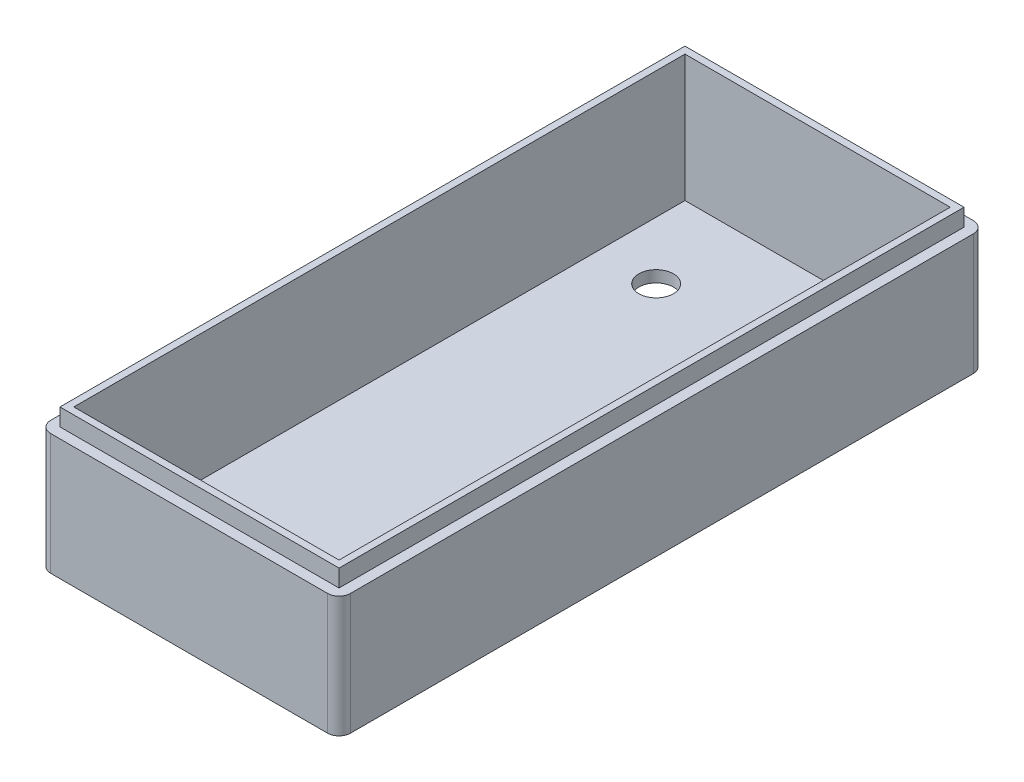
ISO-10303-21;
HEADER;
FILE_DESCRIPTION(('STEP AP214'),'2;1');
FILE_NAME('part.step','',(''),(''),'','','');
FILE_SCHEMA(('AUTOMOTIVE_DESIGN { 1 0 10303 214 1 1 1 1 }'));
ENDSEC;
DATA;
#1=APPLICATION_CONTEXT('core data for automotive mechanical design processes');
#2=APPLICATION_PROTOCOL_DEFINITION('international standard','automotive_design',2000,#1);
#3=PRODUCT_CONTEXT('',#1,'mechanical');
#4=PRODUCT('Part','Part','',(#3));
#5=PRODUCT_RELATED_PRODUCT_CATEGORY('part','',(#4));
#6=PRODUCT_DEFINITION_FORMATION('','',#4);
#7=PRODUCT_DEFINITION_CONTEXT('part definition',#1,'design');
#8=PRODUCT_DEFINITION('design','',#6,#7);
#9=PRODUCT_DEFINITION_SHAPE('','',#8);
#10=(LENGTH_UNIT() NAMED_UNIT(*) SI_UNIT(.MILLI.,.METRE.));
#11=(NAMED_UNIT(*) PLANE_ANGLE_UNIT() SI_UNIT($,.RADIAN.));
#12=(NAMED_UNIT(*) SI_UNIT($,.STERADIAN.) SOLID_ANGLE_UNIT());
#13=UNCERTAINTY_MEASURE_WITH_UNIT(LENGTH_MEASURE(1.E-05),#10,'distance_accuracy_value','');
#14=(GEOMETRIC_REPRESENTATION_CONTEXT(3) GLOBAL_UNCERTAINTY_ASSIGNED_CONTEXT((#13)) GLOBAL_UNIT_ASSIGNED_CONTEXT((#10,
#11,#12)) REPRESENTATION_CONTEXT('',''));
#15=CARTESIAN_POINT('',(0.,0.,0.));
#16=DIRECTION('',(0.,0.,1.));
#17=DIRECTION('',(1.,0.,0.));
#18=AXIS2_PLACEMENT_3D('',#15,#16,#17);
#19=CARTESIAN_POINT('',(0.,2.,0.));
#20=DIRECTION('',(0.,1.,0.));
#21=DIRECTION('',(0.,0.,1.));
#22=AXIS2_PLACEMENT_3D('',#19,#20,#21);
#23=PLANE('',#22);
#24=CARTESIAN_POINT('',(-65.0225872689938,2.,39.9199178644764));
#25=DIRECTION('',(0.,1.,0.));
#26=DIRECTION('',(0.,0.,1.));
#27=AXIS2_PLACEMENT_3D('',#24,#25,#26);
#28=CIRCLE('',#27,6.);
#29=CARTESIAN_POINT('',(-65.0225872689938,2.,45.9199178644764));
#30=VERTEX_POINT('',#29);
#31=EDGE_CURVE('E375',#30,#30,#28,.T.);
#32=ORIENTED_EDGE('',*,*,#31,.F.);
#33=EDGE_LOOP('',(#32));
#34=FACE_BOUND('',#33,.T.);
#35=CARTESIAN_POINT('',(-65.0225872689938,2.,-36.0800821355236));
#36=DIRECTION('',(0.,1.,0.));
#37=DIRECTION('',(0.,0.,1.));
#38=AXIS2_PLACEMENT_3D('',#35,#36,#37);
#39=CIRCLE('',#38,3.00000000000001);
#40=CARTESIAN_POINT('',(-65.0225872689938,2.,-33.0800821355236));
#41=VERTEX_POINT('',#40);
#42=EDGE_CURVE('E275',#41,#41,#39,.T.);
#43=ORIENTED_EDGE('',*,*,#42,.F.);
#44=EDGE_LOOP('',(#43));
#45=FACE_BOUND('',#44,.T.);
#46=DIRECTION('',(0.,0.,-1.));
#47=VECTOR('',#46,1.);
#48=CARTESIAN_POINT('',(-29.0225872689938,2.,-51.0800821355236));
#49=LINE('',#48,#47);
#50=CARTESIAN_POINT('',(-29.0225872689938,2.,54.9199178644764));
#51=VERTEX_POINT('',#50);
#52=CARTESIAN_POINT('',(-29.0225872689938,2.,-51.0800821355236));
#53=VERTEX_POINT('',#52);
#54=EDGE_CURVE('E335',#51,#53,#49,.T.);
#55=ORIENTED_EDGE('',*,*,#54,.T.);
#56=DIRECTION('',(-1.,0.,0.));
#57=VECTOR('',#56,1.);
#58=CARTESIAN_POINT('',(-75.0225872689938,2.,-51.0800821355236));
#59=LINE('',#58,#57);
#60=CARTESIAN_POINT('',(-75.0225872689938,2.,-51.0800821355236));
#61=VERTEX_POINT('',#60);
#62=EDGE_CURVE('E327',#53,#61,#59,.T.);
#63=ORIENTED_EDGE('',*,*,#62,.T.);
#64=DIRECTION('',(0.,0.,1.));
#65=VECTOR('',#64,1.);
#66=CARTESIAN_POINT('',(-75.0225872689938,2.,-51.0800821355236));
#67=LINE('',#66,#65);
#68=CARTESIAN_POINT('',(-75.0225872689938,2.,54.9199178644764));
#69=VERTEX_POINT('',#68);
#70=EDGE_CURVE('E330',#61,#69,#67,.T.);
#71=ORIENTED_EDGE('',*,*,#70,.T.);
#72=DIRECTION('',(1.,0.,0.));
#73=VECTOR('',#72,1.);
#74=CARTESIAN_POINT('',(-75.0225872689938,2.,54.9199178644764));
#75=LINE('',#74,#73);
#76=EDGE_CURVE('E332',#69,#51,#75,.T.);
#77=ORIENTED_EDGE('',*,*,#76,.T.);
#78=EDGE_LOOP('',(#55,#63,#71,#77));
#79=FACE_BOUND('',#78,.T.);
#80=ADVANCED_FACE('F131',(#34,#45,#79),#23,.T.);
#81=CARTESIAN_POINT('',(-76.0225872689938,0.,55.9199178644764));
#82=DIRECTION('',(0.,1.,0.));
#83=DIRECTION('',(0.,0.,1.));
#84=AXIS2_PLACEMENT_3D('',#81,#82,#83);
#85=CYLINDRICAL_SURFACE('',#84,2.);
#86=DIRECTION('',(0.,1.,0.));
#87=VECTOR('',#86,1.);
#88=CARTESIAN_POINT('',(-76.0225872689938,0.,57.9199178644764));
#89=LINE('',#88,#87);
#90=CARTESIAN_POINT('',(-76.0225872689938,21.,57.9199178644764));
#91=VERTEX_POINT('',#90);
#92=CARTESIAN_POINT('',(-76.0225872689938,0.,57.9199178644764));
#93=VERTEX_POINT('',#92);
#94=EDGE_CURVE('E370',#91,#93,#89,.F.);
#95=ORIENTED_EDGE('',*,*,#94,.F.);
#96=CARTESIAN_POINT('',(-76.0225872689938,21.,55.9199178644764));
#97=DIRECTION('',(0.,1.,0.));
#98=DIRECTION('',(0.,0.,1.));
#99=AXIS2_PLACEMENT_3D('',#96,#97,#98);
#100=CIRCLE('',#99,2.);
#101=CARTESIAN_POINT('',(-78.0225872689938,21.,55.9199178644764));
#102=VERTEX_POINT('',#101);
#103=EDGE_CURVE('E301',#91,#102,#100,.F.);
#104=ORIENTED_EDGE('',*,*,#103,.T.);
#105=DIRECTION('',(0.,1.,0.));
#106=VECTOR('',#105,1.);
#107=CARTESIAN_POINT('',(-78.0225872689938,0.,55.9199178644764));
#108=LINE('',#107,#106);
#109=CARTESIAN_POINT('',(-78.0225872689938,0.,55.9199178644764));
#110=VERTEX_POINT('',#109);
#111=EDGE_CURVE('E352',#110,#102,#108,.T.);
#112=ORIENTED_EDGE('',*,*,#111,.F.);
#113=CARTESIAN_POINT('',(-76.0225872689938,0.,55.9199178644764));
#114=DIRECTION('',(0.,1.,0.));
#115=DIRECTION('',(0.,0.,1.));
#116=AXIS2_PLACEMENT_3D('',#113,#114,#115);
#117=CIRCLE('',#116,2.);
#118=EDGE_CURVE('E357',#93,#110,#117,.F.);
#119=ORIENTED_EDGE('',*,*,#118,.F.);
#120=EDGE_LOOP('',(#95,#104,#112,#119));
#121=FACE_BOUND('',#120,.T.);
#122=ADVANCED_FACE('F133',(#121),#85,.T.);
#123=CARTESIAN_POINT('',(-28.0225872689938,0.,-52.0800821355236));
#124=DIRECTION('',(0.,1.,0.));
#125=DIRECTION('',(0.,0.,1.));
#126=AXIS2_PLACEMENT_3D('',#123,#124,#125);
#127=CYLINDRICAL_SURFACE('',#126,2.);
#128=DIRECTION('',(0.,1.,0.));
#129=VECTOR('',#128,1.);
#130=CARTESIAN_POINT('',(-28.0225872689938,0.,-54.0800821355236));
#131=LINE('',#130,#129);
#132=CARTESIAN_POINT('',(-28.0225872689938,21.,-54.0800821355236));
#133=VERTEX_POINT('',#132);
#134=CARTESIAN_POINT('',(-28.0225872689938,0.,-54.0800821355236));
#135=VERTEX_POINT('',#134);
#136=EDGE_CURVE('E347',#133,#135,#131,.F.);
#137=ORIENTED_EDGE('',*,*,#136,.F.);
#138=CARTESIAN_POINT('',(-28.0225872689938,21.,-52.0800821355236));
#139=DIRECTION('',(0.,1.,0.));
#140=DIRECTION('',(0.,0.,1.));
#141=AXIS2_PLACEMENT_3D('',#138,#139,#140);
#142=CIRCLE('',#141,2.);
#143=CARTESIAN_POINT('',(-26.0225872689938,21.,-52.0800821355236));
#144=VERTEX_POINT('',#143);
#145=EDGE_CURVE('E289',#133,#144,#142,.F.);
#146=ORIENTED_EDGE('',*,*,#145,.T.);
#147=DIRECTION('',(0.,1.,0.));
#148=VECTOR('',#147,1.);
#149=CARTESIAN_POINT('',(-26.0225872689938,0.,-52.0800821355236));
#150=LINE('',#149,#148);
#151=CARTESIAN_POINT('',(-26.0225872689938,0.,-52.0800821355236));
#152=VERTEX_POINT('',#151);
#153=EDGE_CURVE('E367',#152,#144,#150,.T.);
#154=ORIENTED_EDGE('',*,*,#153,.F.);
#155=CARTESIAN_POINT('',(-28.0225872689938,0.,-52.0800821355236));
#156=DIRECTION('',(0.,1.,0.));
#157=DIRECTION('',(0.,0.,1.));
#158=AXIS2_PLACEMENT_3D('',#155,#156,#157);
#159=CIRCLE('',#158,2.);
#160=EDGE_CURVE('E361',#135,#152,#159,.F.);
#161=ORIENTED_EDGE('',*,*,#160,.F.);
#162=EDGE_LOOP('',(#137,#146,#154,#161));
#163=FACE_BOUND('',#162,.T.);
#164=ADVANCED_FACE('F467',(#163),#127,.T.);
#165=CARTESIAN_POINT('',(-76.0225872689938,0.,-52.0800821355236));
#166=DIRECTION('',(0.,1.,0.));
#167=DIRECTION('',(0.,0.,1.));
#168=AXIS2_PLACEMENT_3D('',#165,#166,#167);
#169=CYLINDRICAL_SURFACE('',#168,2.);
#170=DIRECTION('',(0.,1.,0.));
#171=VECTOR('',#170,1.);
#172=CARTESIAN_POINT('',(-78.0225872689938,0.,-52.0800821355236));
#173=LINE('',#172,#171);
#174=CARTESIAN_POINT('',(-78.0225872689938,21.,-52.0800821355236));
#175=VERTEX_POINT('',#174);
#176=CARTESIAN_POINT('',(-78.0225872689938,0.,-52.0800821355236));
#177=VERTEX_POINT('',#176);
#178=EDGE_CURVE('E355',#175,#177,#173,.F.);
#179=ORIENTED_EDGE('',*,*,#178,.F.);
#180=CARTESIAN_POINT('',(-76.0225872689938,21.,-52.0800821355236));
#181=DIRECTION('',(0.,1.,0.));
#182=DIRECTION('',(0.,0.,1.));
#183=AXIS2_PLACEMENT_3D('',#180,#181,#182);
#184=CIRCLE('',#183,2.);
#185=CARTESIAN_POINT('',(-76.0225872689938,21.,-54.0800821355236));
#186=VERTEX_POINT('',#185);
#187=EDGE_CURVE('E298',#175,#186,#184,.F.);
#188=ORIENTED_EDGE('',*,*,#187,.T.);
#189=DIRECTION('',(0.,1.,0.));
#190=VECTOR('',#189,1.);
#191=CARTESIAN_POINT('',(-76.0225872689938,0.,-54.0800821355236));
#192=LINE('',#191,#190);
#193=CARTESIAN_POINT('',(-76.0225872689938,0.,-54.0800821355236));
#194=VERTEX_POINT('',#193);
#195=EDGE_CURVE('E349',#194,#186,#192,.T.);
#196=ORIENTED_EDGE('',*,*,#195,.F.);
#197=CARTESIAN_POINT('',(-76.0225872689938,0.,-52.0800821355236));
#198=DIRECTION('',(0.,1.,0.));
#199=DIRECTION('',(0.,0.,1.));
#200=AXIS2_PLACEMENT_3D('',#197,#198,#199);
#201=CIRCLE('',#200,2.);
#202=EDGE_CURVE('E363',#177,#194,#201,.F.);
#203=ORIENTED_EDGE('',*,*,#202,.F.);
#204=EDGE_LOOP('',(#179,#188,#196,#203));
#205=FACE_BOUND('',#204,.T.);
#206=ADVANCED_FACE('F449',(#205),#169,.T.);
#207=CARTESIAN_POINT('',(-26.0225872689938,0.,-54.0800821355236));
#208=DIRECTION('',(0.,0.,-1.));
#209=DIRECTION('',(-1.,0.,0.));
#210=AXIS2_PLACEMENT_3D('',#207,#208,#209);
#211=PLANE('',#210);
#212=ORIENTED_EDGE('',*,*,#195,.T.);
#213=DIRECTION('',(1.,0.,0.));
#214=VECTOR('',#213,1.);
#215=CARTESIAN_POINT('',(-26.0225872689938,21.,-54.0800821355236));
#216=LINE('',#215,#214);
#217=EDGE_CURVE('E295',#186,#133,#216,.T.);
#218=ORIENTED_EDGE('',*,*,#217,.T.);
#219=ORIENTED_EDGE('',*,*,#136,.T.);
#220=DIRECTION('',(-1.,0.,0.));
#221=VECTOR('',#220,1.);
#222=CARTESIAN_POINT('',(-26.0225872689938,0.,-54.0800821355236));
#223=LINE('',#222,#221);
#224=EDGE_CURVE('E318',#135,#194,#223,.T.);
#225=ORIENTED_EDGE('',*,*,#224,.T.);
#226=EDGE_LOOP('',(#212,#218,#219,#225));
#227=FACE_BOUND('',#226,.T.);
#228=ADVANCED_FACE('F445',(#227),#211,.T.);
#229=CARTESIAN_POINT('',(-78.0225872689938,0.,-54.0800821355236));
#230=DIRECTION('',(-1.,0.,0.));
#231=DIRECTION('',(0.,0.,1.));
#232=AXIS2_PLACEMENT_3D('',#229,#230,#231);
#233=PLANE('',#232);
#234=ORIENTED_EDGE('',*,*,#111,.T.);
#235=DIRECTION('',(0.,0.,-1.));
#236=VECTOR('',#235,1.);
#237=CARTESIAN_POINT('',(-78.0225872689938,21.,-54.0800821355236));
#238=LINE('',#237,#236);
#239=EDGE_CURVE('E304',#102,#175,#238,.T.);
#240=ORIENTED_EDGE('',*,*,#239,.T.);
#241=ORIENTED_EDGE('',*,*,#178,.T.);
#242=DIRECTION('',(0.,0.,1.));
#243=VECTOR('',#242,1.);
#244=CARTESIAN_POINT('',(-78.0225872689938,0.,-54.0800821355236));
#245=LINE('',#244,#243);
#246=EDGE_CURVE('E321',#177,#110,#245,.T.);
#247=ORIENTED_EDGE('',*,*,#246,.T.);
#248=EDGE_LOOP('',(#234,#240,#241,#247));
#249=FACE_BOUND('',#248,.T.);
#250=ADVANCED_FACE('F442',(#249),#233,.T.);
#251=CARTESIAN_POINT('',(-28.0225872689938,0.,55.9199178644764));
#252=DIRECTION('',(0.,1.,0.));
#253=DIRECTION('',(0.,0.,1.));
#254=AXIS2_PLACEMENT_3D('',#251,#252,#253);
#255=CYLINDRICAL_SURFACE('',#254,2.);
#256=DIRECTION('',(0.,1.,0.));
#257=VECTOR('',#256,1.);
#258=CARTESIAN_POINT('',(-26.0225872689938,0.,55.9199178644764));
#259=LINE('',#258,#257);
#260=CARTESIAN_POINT('',(-26.0225872689938,21.,55.9199178644764));
#261=VERTEX_POINT('',#260);
#262=CARTESIAN_POINT('',(-26.0225872689938,0.,55.9199178644764));
#263=VERTEX_POINT('',#262);
#264=EDGE_CURVE('E365',#261,#263,#259,.F.);
#265=ORIENTED_EDGE('',*,*,#264,.F.);
#266=CARTESIAN_POINT('',(-28.0225872689938,21.,55.9199178644764));
#267=DIRECTION('',(0.,1.,0.));
#268=DIRECTION('',(0.,0.,1.));
#269=AXIS2_PLACEMENT_3D('',#266,#267,#268);
#270=CIRCLE('',#269,2.);
#271=CARTESIAN_POINT('',(-28.0225872689938,21.,57.9199178644764));
#272=VERTEX_POINT('',#271);
#273=EDGE_CURVE('E148',#261,#272,#270,.F.);
#274=ORIENTED_EDGE('',*,*,#273,.T.);
#275=DIRECTION('',(0.,1.,0.));
#276=VECTOR('',#275,1.);
#277=CARTESIAN_POINT('',(-28.0225872689938,0.,57.9199178644764));
#278=LINE('',#277,#276);
#279=CARTESIAN_POINT('',(-28.0225872689938,0.,57.9199178644764));
#280=VERTEX_POINT('',#279);
#281=EDGE_CURVE('E140',#280,#272,#278,.T.);
#282=ORIENTED_EDGE('',*,*,#281,.F.);
#283=CARTESIAN_POINT('',(-28.0225872689938,0.,55.9199178644764));
#284=DIRECTION('',(0.,1.,0.));
#285=DIRECTION('',(0.,0.,1.));
#286=AXIS2_PLACEMENT_3D('',#283,#284,#285);
#287=CIRCLE('',#286,2.);
#288=EDGE_CURVE('E359',#263,#280,#287,.F.);
#289=ORIENTED_EDGE('',*,*,#288,.F.);
#290=EDGE_LOOP('',(#265,#274,#282,#289));
#291=FACE_BOUND('',#290,.T.);
#292=ADVANCED_FACE('F440',(#291),#255,.T.);
#293=CARTESIAN_POINT('',(-78.0225872689938,0.,57.9199178644764));
#294=DIRECTION('',(0.,0.,1.));
#295=DIRECTION('',(1.,0.,0.));
#296=AXIS2_PLACEMENT_3D('',#293,#294,#295);
#297=PLANE('',#296);
#298=ORIENTED_EDGE('',*,*,#281,.T.);
#299=DIRECTION('',(-1.,0.,0.));
#300=VECTOR('',#299,1.);
#301=CARTESIAN_POINT('',(-78.0225872689938,21.,57.9199178644764));
#302=LINE('',#301,#300);
#303=EDGE_CURVE('E292',#272,#91,#302,.T.);
#304=ORIENTED_EDGE('',*,*,#303,.T.);
#305=ORIENTED_EDGE('',*,*,#94,.T.);
#306=DIRECTION('',(1.,0.,0.));
#307=VECTOR('',#306,1.);
#308=CARTESIAN_POINT('',(-78.0225872689938,0.,57.9199178644764));
#309=LINE('',#308,#307);
#310=EDGE_CURVE('E324',#93,#280,#309,.T.);
#311=ORIENTED_EDGE('',*,*,#310,.T.);
#312=EDGE_LOOP('',(#298,#304,#305,#311));
#313=FACE_BOUND('',#312,.T.);
#314=ADVANCED_FACE('F437',(#313),#297,.T.);
#315=CARTESIAN_POINT('',(-26.0225872689938,0.,57.9199178644764));
#316=DIRECTION('',(1.,0.,0.));
#317=DIRECTION('',(0.,0.,-1.));
#318=AXIS2_PLACEMENT_3D('',#315,#316,#317);
#319=PLANE('',#318);
#320=ORIENTED_EDGE('',*,*,#153,.T.);
#321=DIRECTION('',(0.,0.,1.));
#322=VECTOR('',#321,1.);
#323=CARTESIAN_POINT('',(-26.0225872689938,21.,57.9199178644764));
#324=LINE('',#323,#322);
#325=EDGE_CURVE('E12',#144,#261,#324,.T.);
#326=ORIENTED_EDGE('',*,*,#325,.T.);
#327=ORIENTED_EDGE('',*,*,#264,.T.);
#328=DIRECTION('',(0.,0.,-1.));
#329=VECTOR('',#328,1.);
#330=CARTESIAN_POINT('',(-26.0225872689938,0.,57.9199178644764));
#331=LINE('',#330,#329);
#332=EDGE_CURVE('E315',#263,#152,#331,.T.);
#333=ORIENTED_EDGE('',*,*,#332,.T.);
#334=EDGE_LOOP('',(#320,#326,#327,#333));
#335=FACE_BOUND('',#334,.T.);
#336=ADVANCED_FACE('F416',(#335),#319,.T.);
#337=CARTESIAN_POINT('',(-84.3922729527369,24.,-72.0800821355236));
#338=DIRECTION('',(0.,-1.,0.));
#339=DIRECTION('',(0.,0.,-1.));
#340=AXIS2_PLACEMENT_3D('',#337,#338,#339);
#341=PLANE('',#340);
#342=DIRECTION('',(1.,0.,0.));
#343=VECTOR('',#342,1.);
#344=CARTESIAN_POINT('',(-75.0225872689938,24.,-51.0800821355236));
#345=LINE('',#344,#343);
#346=CARTESIAN_POINT('',(-75.0225872689938,24.,-51.0800821355236));
#347=VERTEX_POINT('',#346);
#348=CARTESIAN_POINT('',(-29.0225872689938,24.,-51.0800821355236));
#349=VERTEX_POINT('',#348);
#350=EDGE_CURVE('E313',#347,#349,#345,.T.);
#351=ORIENTED_EDGE('',*,*,#350,.T.);
#352=DIRECTION('',(0.,0.,1.));
#353=VECTOR('',#352,1.);
#354=CARTESIAN_POINT('',(-29.0225872689938,24.,-51.0800821355236));
#355=LINE('',#354,#353);
#356=CARTESIAN_POINT('',(-29.0225872689938,24.,54.9199178644764));
#357=VERTEX_POINT('',#356);
#358=EDGE_CURVE('E307',#349,#357,#355,.T.);
#359=ORIENTED_EDGE('',*,*,#358,.T.);
#360=DIRECTION('',(-1.,0.,0.));
#361=VECTOR('',#360,1.);
#362=CARTESIAN_POINT('',(-75.0225872689938,24.,54.9199178644764));
#363=LINE('',#362,#361);
#364=CARTESIAN_POINT('',(-75.0225872689938,24.,54.9199178644764));
#365=VERTEX_POINT('',#364);
#366=EDGE_CURVE('E309',#357,#365,#363,.T.);
#367=ORIENTED_EDGE('',*,*,#366,.T.);
#368=DIRECTION('',(0.,0.,-1.));
#369=VECTOR('',#368,1.);
#370=CARTESIAN_POINT('',(-75.0225872689938,24.,-51.0800821355236));
#371=LINE('',#370,#369);
#372=EDGE_CURVE('E311',#365,#347,#371,.T.);
#373=ORIENTED_EDGE('',*,*,#372,.T.);
#374=EDGE_LOOP('',(#351,#359,#367,#373));
#375=FACE_BOUND('',#374,.T.);
#376=DIRECTION('',(0.,0.,1.));
#377=VECTOR('',#376,1.);
#378=CARTESIAN_POINT('',(-76.2225872689938,24.,-52.2800821355236));
#379=LINE('',#378,#377);
#380=CARTESIAN_POINT('',(-76.2225872689938,24.,-52.2800821355236));
#381=VERTEX_POINT('',#380);
#382=CARTESIAN_POINT('',(-76.2225872689938,24.,56.1199178644764));
#383=VERTEX_POINT('',#382);
#384=EDGE_CURVE('E280',#381,#383,#379,.T.);
#385=ORIENTED_EDGE('',*,*,#384,.T.);
#386=DIRECTION('',(1.,0.,0.));
#387=VECTOR('',#386,1.);
#388=CARTESIAN_POINT('',(-76.2225872689938,24.,56.1199178644764));
#389=LINE('',#388,#387);
#390=CARTESIAN_POINT('',(-27.8225872689938,24.,56.1199178644764));
#391=VERTEX_POINT('',#390);
#392=EDGE_CURVE('E251',#383,#391,#389,.T.);
#393=ORIENTED_EDGE('',*,*,#392,.T.);
#394=DIRECTION('',(0.,0.,-1.));
#395=VECTOR('',#394,1.);
#396=CARTESIAN_POINT('',(-27.8225872689938,24.,56.1199178644764));
#397=LINE('',#396,#395);
#398=CARTESIAN_POINT('',(-27.8225872689938,24.,-52.2800821355236));
#399=VERTEX_POINT('',#398);
#400=EDGE_CURVE('E155',#391,#399,#397,.T.);
#401=ORIENTED_EDGE('',*,*,#400,.T.);
#402=DIRECTION('',(-1.,0.,0.));
#403=VECTOR('',#402,1.);
#404=CARTESIAN_POINT('',(-27.8225872689938,24.,-52.2800821355236));
#405=LINE('',#404,#403);
#406=EDGE_CURVE('E270',#399,#381,#405,.T.);
#407=ORIENTED_EDGE('',*,*,#406,.T.);
#408=EDGE_LOOP('',(#385,#393,#401,#407));
#409=FACE_BOUND('',#408,.T.);
#410=ADVANCED_FACE('F413',(#375,#409),#341,.F.);
#411=CARTESIAN_POINT('',(-75.0225872689938,13.,-51.0800821355236));
#412=DIRECTION('',(0.,0.,1.));
#413=DIRECTION('',(1.,0.,0.));
#414=AXIS2_PLACEMENT_3D('',#411,#412,#413);
#415=PLANE('',#414);
#416=ORIENTED_EDGE('',*,*,#350,.F.);
#417=DIRECTION('',(0.,-1.,0.));
#418=VECTOR('',#417,1.);
#419=CARTESIAN_POINT('',(-75.0225872689938,13.,-51.0800821355236));
#420=LINE('',#419,#418);
#421=EDGE_CURVE('E345',#347,#61,#420,.T.);
#422=ORIENTED_EDGE('',*,*,#421,.T.);
#423=ORIENTED_EDGE('',*,*,#62,.F.);
#424=DIRECTION('',(0.,-1.,0.));
#425=VECTOR('',#424,1.);
#426=CARTESIAN_POINT('',(-29.0225872689938,13.,-51.0800821355236));
#427=LINE('',#426,#425);
#428=EDGE_CURVE('E337',#349,#53,#427,.T.);
#429=ORIENTED_EDGE('',*,*,#428,.F.);
#430=EDGE_LOOP('',(#416,#422,#423,#429));
#431=FACE_BOUND('',#430,.T.);
#432=ADVANCED_FACE('F403',(#431),#415,.T.);
#433=CARTESIAN_POINT('',(-75.0225872689938,13.,-51.0800821355236));
#434=DIRECTION('',(1.,0.,0.));
#435=DIRECTION('',(0.,0.,-1.));
#436=AXIS2_PLACEMENT_3D('',#433,#434,#435);
#437=PLANE('',#436);
#438=DIRECTION('',(0.,-1.,0.));
#439=VECTOR('',#438,1.);
#440=CARTESIAN_POINT('',(-75.0225872689938,13.,54.9199178644764));
#441=LINE('',#440,#439);
#442=EDGE_CURVE('E342',#365,#69,#441,.T.);
#443=ORIENTED_EDGE('',*,*,#442,.T.);
#444=ORIENTED_EDGE('',*,*,#70,.F.);
#445=ORIENTED_EDGE('',*,*,#421,.F.);
#446=ORIENTED_EDGE('',*,*,#372,.F.);
#447=EDGE_LOOP('',(#443,#444,#445,#446));
#448=FACE_BOUND('',#447,.T.);
#449=ADVANCED_FACE('F407',(#448),#437,.T.);
#450=CARTESIAN_POINT('',(-75.0225872689938,13.,54.9199178644764));
#451=DIRECTION('',(0.,0.,-1.));
#452=DIRECTION('',(-1.,0.,0.));
#453=AXIS2_PLACEMENT_3D('',#450,#451,#452);
#454=PLANE('',#453);
#455=ORIENTED_EDGE('',*,*,#366,.F.);
#456=DIRECTION('',(0.,-1.,0.));
#457=VECTOR('',#456,1.);
#458=CARTESIAN_POINT('',(-29.0225872689938,13.,54.9199178644764));
#459=LINE('',#458,#457);
#460=EDGE_CURVE('E340',#357,#51,#459,.T.);
#461=ORIENTED_EDGE('',*,*,#460,.T.);
#462=ORIENTED_EDGE('',*,*,#76,.F.);
#463=ORIENTED_EDGE('',*,*,#442,.F.);
#464=EDGE_LOOP('',(#455,#461,#462,#463));
#465=FACE_BOUND('',#464,.T.);
#466=ADVANCED_FACE('F411',(#465),#454,.T.);
#467=CARTESIAN_POINT('',(-29.0225872689938,13.,-51.0800821355236));
#468=DIRECTION('',(-1.,0.,0.));
#469=DIRECTION('',(0.,0.,1.));
#470=AXIS2_PLACEMENT_3D('',#467,#468,#469);
#471=PLANE('',#470);
#472=ORIENTED_EDGE('',*,*,#358,.F.);
#473=ORIENTED_EDGE('',*,*,#428,.T.);
#474=ORIENTED_EDGE('',*,*,#54,.F.);
#475=ORIENTED_EDGE('',*,*,#460,.F.);
#476=EDGE_LOOP('',(#472,#473,#474,#475));
#477=FACE_BOUND('',#476,.T.);
#478=ADVANCED_FACE('F400',(#477),#471,.T.);
#479=CARTESIAN_POINT('',(0.,0.,0.));
#480=DIRECTION('',(0.,1.,0.));
#481=DIRECTION('',(0.,0.,1.));
#482=AXIS2_PLACEMENT_3D('',#479,#480,#481);
#483=PLANE('',#482);
#484=CARTESIAN_POINT('',(-65.0225872689938,0.,39.9199178644764));
#485=DIRECTION('',(0.,1.,0.));
#486=DIRECTION('',(0.,0.,1.));
#487=AXIS2_PLACEMENT_3D('',#484,#485,#486);
#488=CIRCLE('',#487,6.);
#489=CARTESIAN_POINT('',(-65.0225872689938,0.,45.9199178644764));
#490=VERTEX_POINT('',#489);
#491=EDGE_CURVE('E135',#490,#490,#488,.T.);
#492=ORIENTED_EDGE('',*,*,#491,.T.);
#493=EDGE_LOOP('',(#492));
#494=FACE_BOUND('',#493,.T.);
#495=CARTESIAN_POINT('',(-65.0225872689938,0.,-36.0800821355236));
#496=DIRECTION('',(0.,1.,0.));
#497=DIRECTION('',(0.,0.,1.));
#498=AXIS2_PLACEMENT_3D('',#495,#496,#497);
#499=CIRCLE('',#498,3.00000000000001);
#500=CARTESIAN_POINT('',(-65.0225872689938,0.,-33.0800821355236));
#501=VERTEX_POINT('',#500);
#502=EDGE_CURVE('E373',#501,#501,#499,.T.);
#503=ORIENTED_EDGE('',*,*,#502,.T.);
#504=EDGE_LOOP('',(#503));
#505=FACE_BOUND('',#504,.T.);
#506=ORIENTED_EDGE('',*,*,#246,.F.);
#507=ORIENTED_EDGE('',*,*,#202,.T.);
#508=ORIENTED_EDGE('',*,*,#224,.F.);
#509=ORIENTED_EDGE('',*,*,#160,.T.);
#510=ORIENTED_EDGE('',*,*,#332,.F.);
#511=ORIENTED_EDGE('',*,*,#288,.T.);
#512=ORIENTED_EDGE('',*,*,#310,.F.);
#513=ORIENTED_EDGE('',*,*,#118,.T.);
#514=EDGE_LOOP('',(#506,#507,#508,#509,#510,#511,#512,#513));
#515=FACE_BOUND('',#514,.T.);
#516=ADVANCED_FACE('F435',(#494,#505,#515),#483,.F.);
#517=CARTESIAN_POINT('',(0.,21.,0.));
#518=DIRECTION('',(0.,1.,0.));
#519=DIRECTION('',(0.,0.,1.));
#520=AXIS2_PLACEMENT_3D('',#517,#518,#519);
#521=PLANE('',#520);
#522=ORIENTED_EDGE('',*,*,#103,.F.);
#523=ORIENTED_EDGE('',*,*,#303,.F.);
#524=ORIENTED_EDGE('',*,*,#273,.F.);
#525=ORIENTED_EDGE('',*,*,#325,.F.);
#526=ORIENTED_EDGE('',*,*,#145,.F.);
#527=ORIENTED_EDGE('',*,*,#217,.F.);
#528=ORIENTED_EDGE('',*,*,#187,.F.);
#529=ORIENTED_EDGE('',*,*,#239,.F.);
#530=EDGE_LOOP('',(#522,#523,#524,#525,#526,#527,#528,#529));
#531=FACE_BOUND('',#530,.T.);
#532=DIRECTION('',(-1.,0.,0.));
#533=VECTOR('',#532,1.);
#534=CARTESIAN_POINT('',(-27.8225872689938,21.,-52.2800821355236));
#535=LINE('',#534,#533);
#536=CARTESIAN_POINT('',(-27.8225872689938,21.,-52.2800821355236));
#537=VERTEX_POINT('',#536);
#538=CARTESIAN_POINT('',(-76.2225872689938,21.,-52.2800821355236));
#539=VERTEX_POINT('',#538);
#540=EDGE_CURVE('E257',#537,#539,#535,.T.);
#541=ORIENTED_EDGE('',*,*,#540,.F.);
#542=DIRECTION('',(0.,0.,-1.));
#543=VECTOR('',#542,1.);
#544=CARTESIAN_POINT('',(-27.8225872689938,21.,56.1199178644764));
#545=LINE('',#544,#543);
#546=CARTESIAN_POINT('',(-27.8225872689938,21.,56.1199178644764));
#547=VERTEX_POINT('',#546);
#548=EDGE_CURVE('E266',#547,#537,#545,.T.);
#549=ORIENTED_EDGE('',*,*,#548,.F.);
#550=DIRECTION('',(1.,0.,0.));
#551=VECTOR('',#550,1.);
#552=CARTESIAN_POINT('',(-76.2225872689938,21.,56.1199178644764));
#553=LINE('',#552,#551);
#554=CARTESIAN_POINT('',(-76.2225872689938,21.,56.1199178644764));
#555=VERTEX_POINT('',#554);
#556=EDGE_CURVE('E249',#555,#547,#553,.T.);
#557=ORIENTED_EDGE('',*,*,#556,.F.);
#558=DIRECTION('',(0.,0.,1.));
#559=VECTOR('',#558,1.);
#560=CARTESIAN_POINT('',(-76.2225872689938,21.,-52.2800821355236));
#561=LINE('',#560,#559);
#562=EDGE_CURVE('E263',#539,#555,#561,.T.);
#563=ORIENTED_EDGE('',*,*,#562,.F.);
#564=EDGE_LOOP('',(#541,#549,#557,#563));
#565=FACE_BOUND('',#564,.T.);
#566=ADVANCED_FACE('F262',(#531,#565),#521,.T.);
#567=CARTESIAN_POINT('',(-76.2225872689938,21.,-52.2800821355236));
#568=DIRECTION('',(-1.,0.,0.));
#569=DIRECTION('',(0.,0.,1.));
#570=AXIS2_PLACEMENT_3D('',#567,#568,#569);
#571=PLANE('',#570);
#572=ORIENTED_EDGE('',*,*,#384,.F.);
#573=DIRECTION('',(0.,1.,0.));
#574=VECTOR('',#573,1.);
#575=CARTESIAN_POINT('',(-76.2225872689938,21.,-52.2800821355236));
#576=LINE('',#575,#574);
#577=EDGE_CURVE('E269',#539,#381,#576,.T.);
#578=ORIENTED_EDGE('',*,*,#577,.F.);
#579=ORIENTED_EDGE('',*,*,#562,.T.);
#580=DIRECTION('',(0.,1.,0.));
#581=VECTOR('',#580,1.);
#582=CARTESIAN_POINT('',(-76.2225872689938,21.,56.1199178644764));
#583=LINE('',#582,#581);
#584=EDGE_CURVE('E246',#555,#383,#583,.T.);
#585=ORIENTED_EDGE('',*,*,#584,.T.);
#586=EDGE_LOOP('',(#572,#578,#579,#585));
#587=FACE_BOUND('',#586,.T.);
#588=ADVANCED_FACE('F268',(#587),#571,.T.);
#589=CARTESIAN_POINT('',(-27.8225872689938,21.,-52.2800821355236));
#590=DIRECTION('',(0.,0.,-1.));
#591=DIRECTION('',(-1.,0.,0.));
#592=AXIS2_PLACEMENT_3D('',#589,#590,#591);
#593=PLANE('',#592);
#594=ORIENTED_EDGE('',*,*,#406,.F.);
#595=DIRECTION('',(0.,1.,0.));
#596=VECTOR('',#595,1.);
#597=CARTESIAN_POINT('',(-27.8225872689938,21.,-52.2800821355236));
#598=LINE('',#597,#596);
#599=EDGE_CURVE('E285',#537,#399,#598,.T.);
#600=ORIENTED_EDGE('',*,*,#599,.F.);
#601=ORIENTED_EDGE('',*,*,#540,.T.);
#602=ORIENTED_EDGE('',*,*,#577,.T.);
#603=EDGE_LOOP('',(#594,#600,#601,#602));
#604=FACE_BOUND('',#603,.T.);
#605=ADVANCED_FACE('F420',(#604),#593,.T.);
#606=CARTESIAN_POINT('',(-27.8225872689938,21.,56.1199178644764));
#607=DIRECTION('',(1.,0.,0.));
#608=DIRECTION('',(0.,0.,-1.));
#609=AXIS2_PLACEMENT_3D('',#606,#607,#608);
#610=PLANE('',#609);
#611=ORIENTED_EDGE('',*,*,#400,.F.);
#612=DIRECTION('',(0.,1.,0.));
#613=VECTOR('',#612,1.);
#614=CARTESIAN_POINT('',(-27.8225872689938,21.,56.1199178644764));
#615=LINE('',#614,#613);
#616=EDGE_CURVE('E256',#547,#391,#615,.T.);
#617=ORIENTED_EDGE('',*,*,#616,.F.);
#618=ORIENTED_EDGE('',*,*,#548,.T.);
#619=ORIENTED_EDGE('',*,*,#599,.T.);
#620=EDGE_LOOP('',(#611,#617,#618,#619));
#621=FACE_BOUND('',#620,.T.);
#622=ADVANCED_FACE('F421',(#621),#610,.T.);
#623=CARTESIAN_POINT('',(-76.2225872689938,21.,56.1199178644764));
#624=DIRECTION('',(0.,0.,1.));
#625=DIRECTION('',(1.,0.,0.));
#626=AXIS2_PLACEMENT_3D('',#623,#624,#625);
#627=PLANE('',#626);
#628=ORIENTED_EDGE('',*,*,#392,.F.);
#629=ORIENTED_EDGE('',*,*,#584,.F.);
#630=ORIENTED_EDGE('',*,*,#556,.T.);
#631=ORIENTED_EDGE('',*,*,#616,.T.);
#632=EDGE_LOOP('',(#628,#629,#630,#631));
#633=FACE_BOUND('',#632,.T.);
#634=ADVANCED_FACE('F248',(#633),#627,.T.);
#635=CARTESIAN_POINT('',(-65.0225872689938,-2.5,-36.0800821355236));
#636=DIRECTION('',(0.,1.,0.));
#637=DIRECTION('',(0.,0.,1.));
#638=AXIS2_PLACEMENT_3D('',#635,#636,#637);
#639=CYLINDRICAL_SURFACE('',#638,3.00000000000001);
#640=ORIENTED_EDGE('',*,*,#42,.T.);
#641=EDGE_LOOP('',(#640));
#642=FACE_BOUND('',#641,.T.);
#643=ORIENTED_EDGE('',*,*,#502,.F.);
#644=EDGE_LOOP('',(#643));
#645=FACE_BOUND('',#644,.T.);
#646=ADVANCED_FACE('F385',(#642,#645),#639,.F.);
#647=CARTESIAN_POINT('',(-65.0225872689938,-2.5,39.9199178644764));
#648=DIRECTION('',(0.,1.,0.));
#649=DIRECTION('',(0.,0.,1.));
#650=AXIS2_PLACEMENT_3D('',#647,#648,#649);
#651=CYLINDRICAL_SURFACE('',#650,6.);
#652=ORIENTED_EDGE('',*,*,#31,.T.);
#653=EDGE_LOOP('',(#652));
#654=FACE_BOUND('',#653,.T.);
#655=ORIENTED_EDGE('',*,*,#491,.F.);
#656=EDGE_LOOP('',(#655));
#657=FACE_BOUND('',#656,.T.);
#658=ADVANCED_FACE('F564',(#654,#657),#651,.F.);
#659=CLOSED_SHELL('',(#80,#122,#164,#206,#228,#250,#292,#314,#336,#410,#432,#449,#466,#478,#516,
#566,#588,#605,#622,#634,#646,#658));
#660=MANIFOLD_SOLID_BREP('B2',#659);
#661=ADVANCED_BREP_SHAPE_REPRESENTATION('',(#18,#660),#14);
#662=SHAPE_DEFINITION_REPRESENTATION(#9,#661);
ENDSEC;
END-ISO-10303-21;
